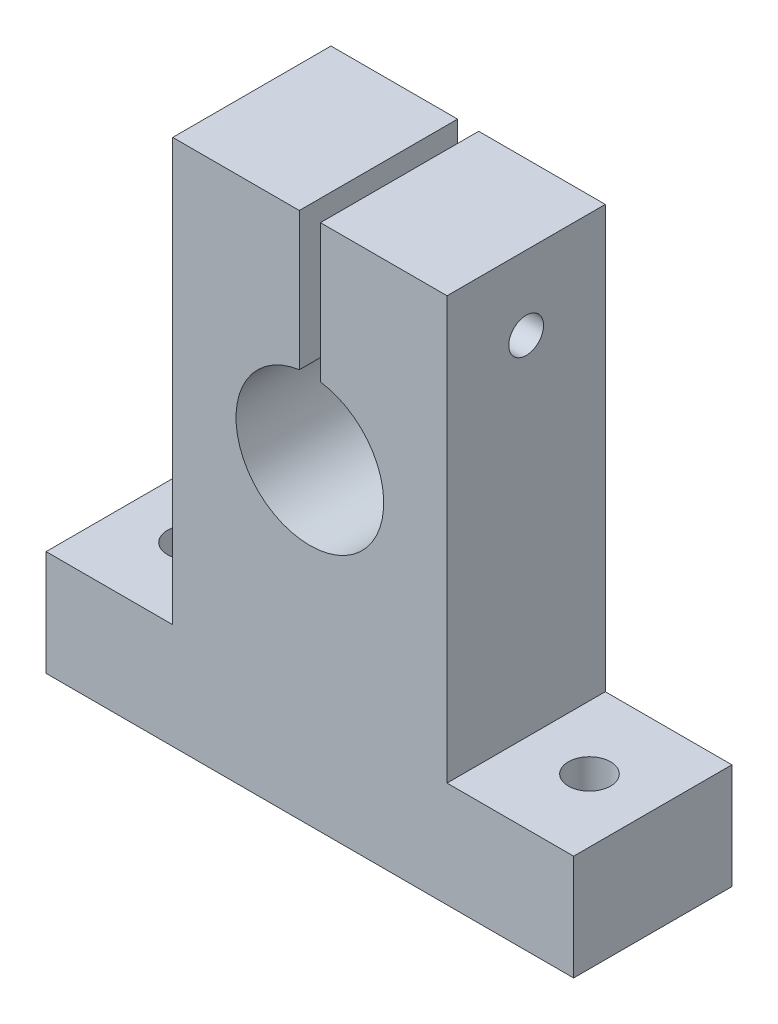
ISO-10303-21;
HEADER;
FILE_DESCRIPTION(('STEP AP214'),'2;1');
FILE_NAME('part.step','',(''),(''),'','','');
FILE_SCHEMA(('AUTOMOTIVE_DESIGN { 1 0 10303 214 1 1 1 1 }'));
ENDSEC;
DATA;
#1=APPLICATION_CONTEXT('core data for automotive mechanical design processes');
#2=APPLICATION_PROTOCOL_DEFINITION('international standard','automotive_design',2000,#1);
#3=PRODUCT_CONTEXT('',#1,'mechanical');
#4=PRODUCT('Part','Part','',(#3));
#5=PRODUCT_RELATED_PRODUCT_CATEGORY('part','',(#4));
#6=PRODUCT_DEFINITION_FORMATION('','',#4);
#7=PRODUCT_DEFINITION_CONTEXT('part definition',#1,'design');
#8=PRODUCT_DEFINITION('design','',#6,#7);
#9=PRODUCT_DEFINITION_SHAPE('','',#8);
#10=(LENGTH_UNIT() NAMED_UNIT(*) SI_UNIT(.MILLI.,.METRE.));
#11=(NAMED_UNIT(*) PLANE_ANGLE_UNIT() SI_UNIT($,.RADIAN.));
#12=(NAMED_UNIT(*) SI_UNIT($,.STERADIAN.) SOLID_ANGLE_UNIT());
#13=UNCERTAINTY_MEASURE_WITH_UNIT(LENGTH_MEASURE(1.E-05),#10,'distance_accuracy_value','');
#14=(GEOMETRIC_REPRESENTATION_CONTEXT(3) GLOBAL_UNCERTAINTY_ASSIGNED_CONTEXT((#13)) GLOBAL_UNIT_ASSIGNED_CONTEXT((#10,
#11,#12)) REPRESENTATION_CONTEXT('',''));
#15=CARTESIAN_POINT('',(0.,0.,0.));
#16=DIRECTION('',(0.,0.,1.));
#17=DIRECTION('',(1.,0.,0.));
#18=AXIS2_PLACEMENT_3D('',#15,#16,#17);
#19=CARTESIAN_POINT('',(12.,-50.,15.));
#20=DIRECTION('',(-1.,0.,0.));
#21=DIRECTION('',(0.,0.,1.));
#22=AXIS2_PLACEMENT_3D('',#19,#20,#21);
#23=PLANE('',#22);
#24=DIRECTION('',(0.,1.,0.));
#25=VECTOR('',#24,1.);
#26=CARTESIAN_POINT('',(12.,-50.,0.));
#27=LINE('',#26,#25);
#28=CARTESIAN_POINT('',(12.,-50.,0.));
#29=VERTEX_POINT('',#28);
#30=CARTESIAN_POINT('',(12.,-40.,0.));
#31=VERTEX_POINT('',#30);
#32=EDGE_CURVE('E157',#29,#31,#27,.T.);
#33=ORIENTED_EDGE('',*,*,#32,.T.);
#34=DIRECTION('',(0.,0.,-1.));
#35=VECTOR('',#34,1.);
#36=CARTESIAN_POINT('',(12.,-40.,15.));
#37=LINE('',#36,#35);
#38=CARTESIAN_POINT('',(12.,-40.,15.));
#39=VERTEX_POINT('',#38);
#40=EDGE_CURVE('E11',#39,#31,#37,.T.);
#41=ORIENTED_EDGE('',*,*,#40,.F.);
#42=DIRECTION('',(0.,1.,0.));
#43=VECTOR('',#42,1.);
#44=CARTESIAN_POINT('',(12.,-50.,15.));
#45=LINE('',#44,#43);
#46=CARTESIAN_POINT('',(12.,-50.,15.));
#47=VERTEX_POINT('',#46);
#48=EDGE_CURVE('E179',#47,#39,#45,.T.);
#49=ORIENTED_EDGE('',*,*,#48,.F.);
#50=DIRECTION('',(0.,0.,-1.));
#51=VECTOR('',#50,1.);
#52=CARTESIAN_POINT('',(12.,-50.,15.));
#53=LINE('',#52,#51);
#54=EDGE_CURVE('E153',#47,#29,#53,.T.);
#55=ORIENTED_EDGE('',*,*,#54,.T.);
#56=EDGE_LOOP('',(#33,#41,#49,#55));
#57=FACE_BOUND('',#56,.T.);
#58=ADVANCED_FACE('F35',(#57),#23,.F.);
#59=CARTESIAN_POINT('',(12.,-40.,15.));
#60=DIRECTION('',(0.,-1.,0.));
#61=DIRECTION('',(0.,0.,-1.));
#62=AXIS2_PLACEMENT_3D('',#59,#60,#61);
#63=PLANE('',#62);
#64=CARTESIAN_POINT('',(6.,-40.,7.5));
#65=DIRECTION('',(0.,1.,0.));
#66=DIRECTION('',(0.,0.,1.));
#67=AXIS2_PLACEMENT_3D('',#64,#65,#66);
#68=CIRCLE('',#67,2.);
#69=CARTESIAN_POINT('',(6.,-40.,9.5));
#70=VERTEX_POINT('',#69);
#71=EDGE_CURVE('E204',#70,#70,#68,.T.);
#72=ORIENTED_EDGE('',*,*,#71,.F.);
#73=EDGE_LOOP('',(#72));
#74=FACE_BOUND('',#73,.T.);
#75=DIRECTION('',(-1.,0.,0.));
#76=VECTOR('',#75,1.);
#77=CARTESIAN_POINT('',(12.,-40.,0.));
#78=LINE('',#77,#76);
#79=CARTESIAN_POINT('',(0.,-40.,0.));
#80=VERTEX_POINT('',#79);
#81=EDGE_CURVE('E160',#31,#80,#78,.T.);
#82=ORIENTED_EDGE('',*,*,#81,.T.);
#83=DIRECTION('',(0.,0.,-1.));
#84=VECTOR('',#83,1.);
#85=CARTESIAN_POINT('',(0.,-40.,15.));
#86=LINE('',#85,#84);
#87=CARTESIAN_POINT('',(0.,-40.,15.));
#88=VERTEX_POINT('',#87);
#89=EDGE_CURVE('E44',#88,#80,#86,.T.);
#90=ORIENTED_EDGE('',*,*,#89,.F.);
#91=DIRECTION('',(-1.,0.,0.));
#92=VECTOR('',#91,1.);
#93=CARTESIAN_POINT('',(12.,-40.,15.));
#94=LINE('',#93,#92);
#95=EDGE_CURVE('E108',#39,#88,#94,.T.);
#96=ORIENTED_EDGE('',*,*,#95,.F.);
#97=ORIENTED_EDGE('',*,*,#40,.T.);
#98=EDGE_LOOP('',(#82,#90,#96,#97));
#99=FACE_BOUND('',#98,.T.);
#100=ADVANCED_FACE('F261',(#74,#99),#63,.F.);
#101=CARTESIAN_POINT('',(0.,-40.,15.));
#102=DIRECTION('',(-1.,0.,0.));
#103=DIRECTION('',(0.,0.,1.));
#104=AXIS2_PLACEMENT_3D('',#101,#102,#103);
#105=PLANE('',#104);
#106=CARTESIAN_POINT('',(0.,-7.,7.5));
#107=DIRECTION('',(1.,0.,0.));
#108=DIRECTION('',(0.,0.,-1.));
#109=AXIS2_PLACEMENT_3D('',#106,#107,#108);
#110=CIRCLE('',#109,1.65);
#111=CARTESIAN_POINT('',(0.,-7.,5.85));
#112=VERTEX_POINT('',#111);
#113=EDGE_CURVE('E326',#112,#112,#110,.T.);
#114=ORIENTED_EDGE('',*,*,#113,.F.);
#115=EDGE_LOOP('',(#114));
#116=FACE_BOUND('',#115,.T.);
#117=DIRECTION('',(0.,1.,0.));
#118=VECTOR('',#117,1.);
#119=CARTESIAN_POINT('',(0.,-40.,0.));
#120=LINE('',#119,#118);
#121=CARTESIAN_POINT('',(0.,0.,0.));
#122=VERTEX_POINT('',#121);
#123=EDGE_CURVE('E162',#80,#122,#120,.T.);
#124=ORIENTED_EDGE('',*,*,#123,.T.);
#125=DIRECTION('',(0.,0.,-1.));
#126=VECTOR('',#125,1.);
#127=CARTESIAN_POINT('',(0.,0.,15.));
#128=LINE('',#127,#126);
#129=CARTESIAN_POINT('',(0.,0.,15.));
#130=VERTEX_POINT('',#129);
#131=EDGE_CURVE('E198',#130,#122,#128,.T.);
#132=ORIENTED_EDGE('',*,*,#131,.F.);
#133=DIRECTION('',(0.,1.,0.));
#134=VECTOR('',#133,1.);
#135=CARTESIAN_POINT('',(0.,-40.,15.));
#136=LINE('',#135,#134);
#137=EDGE_CURVE('E221',#88,#130,#136,.T.);
#138=ORIENTED_EDGE('',*,*,#137,.F.);
#139=ORIENTED_EDGE('',*,*,#89,.T.);
#140=EDGE_LOOP('',(#124,#132,#138,#139));
#141=FACE_BOUND('',#140,.T.);
#142=ADVANCED_FACE('F265',(#116,#141),#105,.F.);
#143=CARTESIAN_POINT('',(-12.,0.,15.));
#144=DIRECTION('',(0.,-1.,0.));
#145=DIRECTION('',(0.,0.,-1.));
#146=AXIS2_PLACEMENT_3D('',#143,#144,#145);
#147=PLANE('',#146);
#148=DIRECTION('',(-1.,0.,0.));
#149=VECTOR('',#148,1.);
#150=CARTESIAN_POINT('',(-12.,0.,0.));
#151=LINE('',#150,#149);
#152=CARTESIAN_POINT('',(-12.,0.,0.));
#153=VERTEX_POINT('',#152);
#154=EDGE_CURVE('E164',#122,#153,#151,.T.);
#155=ORIENTED_EDGE('',*,*,#154,.T.);
#156=DIRECTION('',(0.,0.,-1.));
#157=VECTOR('',#156,1.);
#158=CARTESIAN_POINT('',(-12.,0.,15.));
#159=LINE('',#158,#157);
#160=CARTESIAN_POINT('',(-12.,0.,15.));
#161=VERTEX_POINT('',#160);
#162=EDGE_CURVE('E195',#161,#153,#159,.T.);
#163=ORIENTED_EDGE('',*,*,#162,.F.);
#164=DIRECTION('',(-1.,0.,0.));
#165=VECTOR('',#164,1.);
#166=CARTESIAN_POINT('',(-12.,0.,15.));
#167=LINE('',#166,#165);
#168=EDGE_CURVE('E223',#130,#161,#167,.T.);
#169=ORIENTED_EDGE('',*,*,#168,.F.);
#170=ORIENTED_EDGE('',*,*,#131,.T.);
#171=EDGE_LOOP('',(#155,#163,#169,#170));
#172=FACE_BOUND('',#171,.T.);
#173=ADVANCED_FACE('F270',(#172),#147,.F.);
#174=CARTESIAN_POINT('',(-12.,0.,15.));
#175=DIRECTION('',(1.,0.,0.));
#176=DIRECTION('',(0.,1.,0.));
#177=AXIS2_PLACEMENT_3D('',#174,#175,#176);
#178=PLANE('',#177);
#179=CARTESIAN_POINT('',(-12.,-7.,7.5));
#180=DIRECTION('',(1.,0.,0.));
#181=DIRECTION('',(0.,1.,0.));
#182=AXIS2_PLACEMENT_3D('',#179,#180,#181);
#183=CIRCLE('',#182,1.65);
#184=CARTESIAN_POINT('',(-12.,-5.35,7.5));
#185=VERTEX_POINT('',#184);
#186=EDGE_CURVE('E323',#185,#185,#183,.T.);
#187=ORIENTED_EDGE('',*,*,#186,.T.);
#188=EDGE_LOOP('',(#187));
#189=FACE_BOUND('',#188,.T.);
#190=DIRECTION('',(0.,-1.,0.));
#191=VECTOR('',#190,1.);
#192=CARTESIAN_POINT('',(-12.,0.,0.));
#193=LINE('',#192,#191);
#194=CARTESIAN_POINT('',(-12.,-13.0717967697245,0.));
#195=VERTEX_POINT('',#194);
#196=EDGE_CURVE('E166',#153,#195,#193,.T.);
#197=ORIENTED_EDGE('',*,*,#196,.T.);
#198=DIRECTION('',(0.,0.,-1.));
#199=VECTOR('',#198,1.);
#200=CARTESIAN_POINT('',(-12.,-13.0717967697245,15.));
#201=LINE('',#200,#199);
#202=CARTESIAN_POINT('',(-12.,-13.0717967697245,15.));
#203=VERTEX_POINT('',#202);
#204=EDGE_CURVE('E192',#203,#195,#201,.T.);
#205=ORIENTED_EDGE('',*,*,#204,.F.);
#206=DIRECTION('',(0.,-1.,0.));
#207=VECTOR('',#206,1.);
#208=CARTESIAN_POINT('',(-12.,0.,15.));
#209=LINE('',#208,#207);
#210=EDGE_CURVE('E225',#161,#203,#209,.T.);
#211=ORIENTED_EDGE('',*,*,#210,.F.);
#212=ORIENTED_EDGE('',*,*,#162,.T.);
#213=EDGE_LOOP('',(#197,#205,#211,#212));
#214=FACE_BOUND('',#213,.T.);
#215=ADVANCED_FACE('F276',(#189,#214),#178,.F.);
#216=CARTESIAN_POINT('',(-13.,-20.,15.));
#217=DIRECTION('',(0.,0.,-1.));
#218=DIRECTION('',(-1.,0.,0.));
#219=AXIS2_PLACEMENT_3D('',#216,#217,#218);
#220=CYLINDRICAL_SURFACE('',#219,7.);
#221=CARTESIAN_POINT('',(-13.,-20.,0.));
#222=DIRECTION('',(0.,0.,-1.));
#223=DIRECTION('',(1.,0.,0.));
#224=AXIS2_PLACEMENT_3D('',#221,#222,#223);
#225=CIRCLE('',#224,7.);
#226=CARTESIAN_POINT('',(-14.,-13.0717967697245,0.));
#227=VERTEX_POINT('',#226);
#228=EDGE_CURVE('E168',#195,#227,#225,.T.);
#229=ORIENTED_EDGE('',*,*,#228,.T.);
#230=DIRECTION('',(0.,0.,-1.));
#231=VECTOR('',#230,1.);
#232=CARTESIAN_POINT('',(-14.,-13.0717967697245,15.));
#233=LINE('',#232,#231);
#234=CARTESIAN_POINT('',(-14.,-13.0717967697245,15.));
#235=VERTEX_POINT('',#234);
#236=EDGE_CURVE('E189',#235,#227,#233,.T.);
#237=ORIENTED_EDGE('',*,*,#236,.F.);
#238=CARTESIAN_POINT('',(-13.,-20.,15.));
#239=DIRECTION('',(0.,0.,-1.));
#240=DIRECTION('',(1.,0.,0.));
#241=AXIS2_PLACEMENT_3D('',#238,#239,#240);
#242=CIRCLE('',#241,7.);
#243=EDGE_CURVE('E227',#203,#235,#242,.T.);
#244=ORIENTED_EDGE('',*,*,#243,.F.);
#245=ORIENTED_EDGE('',*,*,#204,.T.);
#246=EDGE_LOOP('',(#229,#237,#244,#245));
#247=FACE_BOUND('',#246,.T.);
#248=ADVANCED_FACE('F280',(#247),#220,.F.);
#249=CARTESIAN_POINT('',(-14.,0.,15.));
#250=DIRECTION('',(-1.,0.,0.));
#251=DIRECTION('',(0.,-1.,0.));
#252=AXIS2_PLACEMENT_3D('',#249,#250,#251);
#253=PLANE('',#252);
#254=CARTESIAN_POINT('',(-14.,-7.,7.56985297052041));
#255=DIRECTION('',(-1.,0.,0.));
#256=DIRECTION('',(0.,-1.,0.));
#257=AXIS2_PLACEMENT_3D('',#254,#255,#256);
#258=CIRCLE('',#257,2.25);
#259=CARTESIAN_POINT('',(-14.,-9.25,7.56985297052041));
#260=VERTEX_POINT('',#259);
#261=EDGE_CURVE('E214',#260,#260,#258,.T.);
#262=ORIENTED_EDGE('',*,*,#261,.T.);
#263=EDGE_LOOP('',(#262));
#264=FACE_BOUND('',#263,.T.);
#265=DIRECTION('',(0.,1.,0.));
#266=VECTOR('',#265,1.);
#267=CARTESIAN_POINT('',(-14.,0.,0.));
#268=LINE('',#267,#266);
#269=CARTESIAN_POINT('',(-14.,0.,0.));
#270=VERTEX_POINT('',#269);
#271=EDGE_CURVE('E170',#227,#270,#268,.T.);
#272=ORIENTED_EDGE('',*,*,#271,.T.);
#273=DIRECTION('',(0.,0.,-1.));
#274=VECTOR('',#273,1.);
#275=CARTESIAN_POINT('',(-14.,0.,15.));
#276=LINE('',#275,#274);
#277=CARTESIAN_POINT('',(-14.,0.,15.));
#278=VERTEX_POINT('',#277);
#279=EDGE_CURVE('E186',#278,#270,#276,.T.);
#280=ORIENTED_EDGE('',*,*,#279,.F.);
#281=DIRECTION('',(0.,1.,0.));
#282=VECTOR('',#281,1.);
#283=CARTESIAN_POINT('',(-14.,0.,15.));
#284=LINE('',#283,#282);
#285=EDGE_CURVE('E229',#235,#278,#284,.T.);
#286=ORIENTED_EDGE('',*,*,#285,.F.);
#287=ORIENTED_EDGE('',*,*,#236,.T.);
#288=EDGE_LOOP('',(#272,#280,#286,#287));
#289=FACE_BOUND('',#288,.T.);
#290=ADVANCED_FACE('F284',(#264,#289),#253,.F.);
#291=CARTESIAN_POINT('',(-26.,0.,15.));
#292=DIRECTION('',(0.,-1.,0.));
#293=DIRECTION('',(0.,0.,-1.));
#294=AXIS2_PLACEMENT_3D('',#291,#292,#293);
#295=PLANE('',#294);
#296=DIRECTION('',(-1.,0.,0.));
#297=VECTOR('',#296,1.);
#298=CARTESIAN_POINT('',(-26.,0.,0.));
#299=LINE('',#298,#297);
#300=CARTESIAN_POINT('',(-26.,0.,0.));
#301=VERTEX_POINT('',#300);
#302=EDGE_CURVE('E172',#270,#301,#299,.T.);
#303=ORIENTED_EDGE('',*,*,#302,.T.);
#304=DIRECTION('',(0.,0.,-1.));
#305=VECTOR('',#304,1.);
#306=CARTESIAN_POINT('',(-26.,0.,15.));
#307=LINE('',#306,#305);
#308=CARTESIAN_POINT('',(-26.,0.,15.));
#309=VERTEX_POINT('',#308);
#310=EDGE_CURVE('E183',#309,#301,#307,.T.);
#311=ORIENTED_EDGE('',*,*,#310,.F.);
#312=DIRECTION('',(-1.,0.,0.));
#313=VECTOR('',#312,1.);
#314=CARTESIAN_POINT('',(-26.,0.,15.));
#315=LINE('',#314,#313);
#316=EDGE_CURVE('E231',#278,#309,#315,.T.);
#317=ORIENTED_EDGE('',*,*,#316,.F.);
#318=ORIENTED_EDGE('',*,*,#279,.T.);
#319=EDGE_LOOP('',(#303,#311,#317,#318));
#320=FACE_BOUND('',#319,.T.);
#321=ADVANCED_FACE('F237',(#320),#295,.F.);
#322=CARTESIAN_POINT('',(-26.,0.,15.));
#323=DIRECTION('',(1.,0.,0.));
#324=DIRECTION('',(0.,1.,0.));
#325=AXIS2_PLACEMENT_3D('',#322,#323,#324);
#326=PLANE('',#325);
#327=CARTESIAN_POINT('',(-26.,-7.,7.56985297052041));
#328=DIRECTION('',(-1.,0.,0.));
#329=DIRECTION('',(0.,0.,1.));
#330=AXIS2_PLACEMENT_3D('',#327,#328,#329);
#331=CIRCLE('',#330,2.25);
#332=CARTESIAN_POINT('',(-26.,-7.,9.81985297052041));
#333=VERTEX_POINT('',#332);
#334=EDGE_CURVE('E328',#333,#333,#331,.T.);
#335=ORIENTED_EDGE('',*,*,#334,.F.);
#336=EDGE_LOOP('',(#335));
#337=FACE_BOUND('',#336,.T.);
#338=DIRECTION('',(0.,-1.,0.));
#339=VECTOR('',#338,1.);
#340=CARTESIAN_POINT('',(-26.,0.,0.));
#341=LINE('',#340,#339);
#342=CARTESIAN_POINT('',(-26.,-40.,0.));
#343=VERTEX_POINT('',#342);
#344=EDGE_CURVE('E174',#301,#343,#341,.T.);
#345=ORIENTED_EDGE('',*,*,#344,.T.);
#346=DIRECTION('',(0.,0.,-1.));
#347=VECTOR('',#346,1.);
#348=CARTESIAN_POINT('',(-26.,-40.,15.));
#349=LINE('',#348,#347);
#350=CARTESIAN_POINT('',(-26.,-40.,15.));
#351=VERTEX_POINT('',#350);
#352=EDGE_CURVE('E148',#351,#343,#349,.T.);
#353=ORIENTED_EDGE('',*,*,#352,.F.);
#354=DIRECTION('',(0.,-1.,0.));
#355=VECTOR('',#354,1.);
#356=CARTESIAN_POINT('',(-26.,0.,15.));
#357=LINE('',#356,#355);
#358=EDGE_CURVE('E139',#309,#351,#357,.T.);
#359=ORIENTED_EDGE('',*,*,#358,.F.);
#360=ORIENTED_EDGE('',*,*,#310,.T.);
#361=EDGE_LOOP('',(#345,#353,#359,#360));
#362=FACE_BOUND('',#361,.T.);
#363=ADVANCED_FACE('F241',(#337,#362),#326,.F.);
#364=CARTESIAN_POINT('',(-26.,-40.,15.));
#365=DIRECTION('',(0.,-1.,0.));
#366=DIRECTION('',(1.,0.,0.));
#367=AXIS2_PLACEMENT_3D('',#364,#365,#366);
#368=PLANE('',#367);
#369=CARTESIAN_POINT('',(-32.,-40.,7.5));
#370=DIRECTION('',(0.,1.,0.));
#371=DIRECTION('',(0.,0.,1.));
#372=AXIS2_PLACEMENT_3D('',#369,#370,#371);
#373=CIRCLE('',#372,2.);
#374=CARTESIAN_POINT('',(-32.,-40.,9.5));
#375=VERTEX_POINT('',#374);
#376=EDGE_CURVE('E209',#375,#375,#373,.T.);
#377=ORIENTED_EDGE('',*,*,#376,.F.);
#378=EDGE_LOOP('',(#377));
#379=FACE_BOUND('',#378,.T.);
#380=DIRECTION('',(-1.,0.,0.));
#381=VECTOR('',#380,1.);
#382=CARTESIAN_POINT('',(-26.,-40.,0.));
#383=LINE('',#382,#381);
#384=CARTESIAN_POINT('',(-38.,-40.,0.));
#385=VERTEX_POINT('',#384);
#386=EDGE_CURVE('E147',#343,#385,#383,.T.);
#387=ORIENTED_EDGE('',*,*,#386,.T.);
#388=DIRECTION('',(0.,0.,-1.));
#389=VECTOR('',#388,1.);
#390=CARTESIAN_POINT('',(-38.,-40.,15.));
#391=LINE('',#390,#389);
#392=CARTESIAN_POINT('',(-38.,-40.,15.));
#393=VERTEX_POINT('',#392);
#394=EDGE_CURVE('E144',#393,#385,#391,.T.);
#395=ORIENTED_EDGE('',*,*,#394,.F.);
#396=DIRECTION('',(-1.,0.,0.));
#397=VECTOR('',#396,1.);
#398=CARTESIAN_POINT('',(-26.,-40.,15.));
#399=LINE('',#398,#397);
#400=EDGE_CURVE('E133',#351,#393,#399,.T.);
#401=ORIENTED_EDGE('',*,*,#400,.F.);
#402=ORIENTED_EDGE('',*,*,#352,.T.);
#403=EDGE_LOOP('',(#387,#395,#401,#402));
#404=FACE_BOUND('',#403,.T.);
#405=ADVANCED_FACE('F145',(#379,#404),#368,.F.);
#406=CARTESIAN_POINT('',(-38.,-40.,15.));
#407=DIRECTION('',(1.,0.,0.));
#408=DIRECTION('',(0.,0.,-1.));
#409=AXIS2_PLACEMENT_3D('',#406,#407,#408);
#410=PLANE('',#409);
#411=DIRECTION('',(0.,-1.,0.));
#412=VECTOR('',#411,1.);
#413=CARTESIAN_POINT('',(-38.,-40.,0.));
#414=LINE('',#413,#412);
#415=CARTESIAN_POINT('',(-38.,-50.,0.));
#416=VERTEX_POINT('',#415);
#417=EDGE_CURVE('E94',#385,#416,#414,.T.);
#418=ORIENTED_EDGE('',*,*,#417,.T.);
#419=DIRECTION('',(0.,0.,-1.));
#420=VECTOR('',#419,1.);
#421=CARTESIAN_POINT('',(-38.,-50.,15.));
#422=LINE('',#421,#420);
#423=CARTESIAN_POINT('',(-38.,-50.,15.));
#424=VERTEX_POINT('',#423);
#425=EDGE_CURVE('E149',#424,#416,#422,.T.);
#426=ORIENTED_EDGE('',*,*,#425,.F.);
#427=DIRECTION('',(0.,-1.,0.));
#428=VECTOR('',#427,1.);
#429=CARTESIAN_POINT('',(-38.,-40.,15.));
#430=LINE('',#429,#428);
#431=EDGE_CURVE('E137',#393,#424,#430,.T.);
#432=ORIENTED_EDGE('',*,*,#431,.F.);
#433=ORIENTED_EDGE('',*,*,#394,.T.);
#434=EDGE_LOOP('',(#418,#426,#432,#433));
#435=FACE_BOUND('',#434,.T.);
#436=ADVANCED_FACE('F151',(#435),#410,.F.);
#437=CARTESIAN_POINT('',(-38.,-50.,15.));
#438=DIRECTION('',(0.,1.,0.));
#439=DIRECTION('',(0.,0.,1.));
#440=AXIS2_PLACEMENT_3D('',#437,#438,#439);
#441=PLANE('',#440);
#442=CARTESIAN_POINT('',(6.,-50.,7.5));
#443=DIRECTION('',(0.,1.,0.));
#444=DIRECTION('',(0.,0.,1.));
#445=AXIS2_PLACEMENT_3D('',#442,#443,#444);
#446=CIRCLE('',#445,2.);
#447=CARTESIAN_POINT('',(6.,-50.,9.5));
#448=VERTEX_POINT('',#447);
#449=EDGE_CURVE('E38',#448,#448,#446,.T.);
#450=ORIENTED_EDGE('',*,*,#449,.T.);
#451=EDGE_LOOP('',(#450));
#452=FACE_BOUND('',#451,.T.);
#453=CARTESIAN_POINT('',(-32.,-50.,7.5));
#454=DIRECTION('',(0.,1.,0.));
#455=DIRECTION('',(0.,0.,1.));
#456=AXIS2_PLACEMENT_3D('',#453,#454,#455);
#457=CIRCLE('',#456,2.);
#458=CARTESIAN_POINT('',(-32.,-50.,9.5));
#459=VERTEX_POINT('',#458);
#460=EDGE_CURVE('E202',#459,#459,#457,.T.);
#461=ORIENTED_EDGE('',*,*,#460,.T.);
#462=EDGE_LOOP('',(#461));
#463=FACE_BOUND('',#462,.T.);
#464=DIRECTION('',(1.,0.,0.));
#465=VECTOR('',#464,1.);
#466=CARTESIAN_POINT('',(-38.,-50.,0.));
#467=LINE('',#466,#465);
#468=EDGE_CURVE('E100',#416,#29,#467,.T.);
#469=ORIENTED_EDGE('',*,*,#468,.T.);
#470=ORIENTED_EDGE('',*,*,#54,.F.);
#471=DIRECTION('',(1.,0.,0.));
#472=VECTOR('',#471,1.);
#473=CARTESIAN_POINT('',(-38.,-50.,15.));
#474=LINE('',#473,#472);
#475=EDGE_CURVE('E53',#424,#47,#474,.T.);
#476=ORIENTED_EDGE('',*,*,#475,.F.);
#477=ORIENTED_EDGE('',*,*,#425,.T.);
#478=EDGE_LOOP('',(#469,#470,#476,#477));
#479=FACE_BOUND('',#478,.T.);
#480=ADVANCED_FACE('F249',(#452,#463,#479),#441,.F.);
#481=CARTESIAN_POINT('',(-13.,-20.,15.));
#482=DIRECTION('',(0.,0.,1.));
#483=DIRECTION('',(1.,0.,0.));
#484=AXIS2_PLACEMENT_3D('',#481,#482,#483);
#485=PLANE('',#484);
#486=ORIENTED_EDGE('',*,*,#48,.T.);
#487=ORIENTED_EDGE('',*,*,#95,.T.);
#488=ORIENTED_EDGE('',*,*,#137,.T.);
#489=ORIENTED_EDGE('',*,*,#168,.T.);
#490=ORIENTED_EDGE('',*,*,#210,.T.);
#491=ORIENTED_EDGE('',*,*,#243,.T.);
#492=ORIENTED_EDGE('',*,*,#285,.T.);
#493=ORIENTED_EDGE('',*,*,#316,.T.);
#494=ORIENTED_EDGE('',*,*,#358,.T.);
#495=ORIENTED_EDGE('',*,*,#400,.T.);
#496=ORIENTED_EDGE('',*,*,#431,.T.);
#497=ORIENTED_EDGE('',*,*,#475,.T.);
#498=EDGE_LOOP('',(#486,#487,#488,#489,#490,#491,#492,#493,#494,#495,#496,#497));
#499=FACE_BOUND('',#498,.T.);
#500=ADVANCED_FACE('F135',(#499),#485,.T.);
#501=CARTESIAN_POINT('',(-13.,-20.,0.));
#502=DIRECTION('',(0.,0.,1.));
#503=DIRECTION('',(1.,0.,0.));
#504=AXIS2_PLACEMENT_3D('',#501,#502,#503);
#505=PLANE('',#504);
#506=ORIENTED_EDGE('',*,*,#32,.F.);
#507=ORIENTED_EDGE('',*,*,#468,.F.);
#508=ORIENTED_EDGE('',*,*,#417,.F.);
#509=ORIENTED_EDGE('',*,*,#386,.F.);
#510=ORIENTED_EDGE('',*,*,#344,.F.);
#511=ORIENTED_EDGE('',*,*,#302,.F.);
#512=ORIENTED_EDGE('',*,*,#271,.F.);
#513=ORIENTED_EDGE('',*,*,#228,.F.);
#514=ORIENTED_EDGE('',*,*,#196,.F.);
#515=ORIENTED_EDGE('',*,*,#154,.F.);
#516=ORIENTED_EDGE('',*,*,#123,.F.);
#517=ORIENTED_EDGE('',*,*,#81,.F.);
#518=EDGE_LOOP('',(#506,#507,#508,#509,#510,#511,#512,#513,#514,#515,#516,#517));
#519=FACE_BOUND('',#518,.T.);
#520=ADVANCED_FACE('F244',(#519),#505,.F.);
#521=CARTESIAN_POINT('',(-32.,-55.,7.5));
#522=DIRECTION('',(0.,1.,0.));
#523=DIRECTION('',(0.,0.,1.));
#524=AXIS2_PLACEMENT_3D('',#521,#522,#523);
#525=CYLINDRICAL_SURFACE('',#524,2.);
#526=ORIENTED_EDGE('',*,*,#376,.T.);
#527=EDGE_LOOP('',(#526));
#528=FACE_BOUND('',#527,.T.);
#529=ORIENTED_EDGE('',*,*,#460,.F.);
#530=EDGE_LOOP('',(#529));
#531=FACE_BOUND('',#530,.T.);
#532=ADVANCED_FACE('F300',(#528,#531),#525,.F.);
#533=CARTESIAN_POINT('',(6.,-55.,7.5));
#534=DIRECTION('',(0.,1.,0.));
#535=DIRECTION('',(0.,0.,1.));
#536=AXIS2_PLACEMENT_3D('',#533,#534,#535);
#537=CYLINDRICAL_SURFACE('',#536,2.);
#538=ORIENTED_EDGE('',*,*,#71,.T.);
#539=EDGE_LOOP('',(#538));
#540=FACE_BOUND('',#539,.T.);
#541=ORIENTED_EDGE('',*,*,#449,.F.);
#542=EDGE_LOOP('',(#541));
#543=FACE_BOUND('',#542,.T.);
#544=ADVANCED_FACE('F303',(#540,#543),#537,.F.);
#545=CARTESIAN_POINT('',(-26.,-7.,7.56985297052041));
#546=DIRECTION('',(-1.,0.,0.));
#547=DIRECTION('',(0.,0.,1.));
#548=AXIS2_PLACEMENT_3D('',#545,#546,#547);
#549=CYLINDRICAL_SURFACE('',#548,2.25);
#550=ORIENTED_EDGE('',*,*,#261,.F.);
#551=EDGE_LOOP('',(#550));
#552=FACE_BOUND('',#551,.T.);
#553=ORIENTED_EDGE('',*,*,#334,.T.);
#554=EDGE_LOOP('',(#553));
#555=FACE_BOUND('',#554,.T.);
#556=ADVANCED_FACE('F309',(#552,#555),#549,.F.);
#557=CARTESIAN_POINT('',(0.,-7.,7.5));
#558=DIRECTION('',(1.,0.,0.));
#559=DIRECTION('',(0.,0.,-1.));
#560=AXIS2_PLACEMENT_3D('',#557,#558,#559);
#561=CYLINDRICAL_SURFACE('',#560,1.65);
#562=ORIENTED_EDGE('',*,*,#186,.F.);
#563=EDGE_LOOP('',(#562));
#564=FACE_BOUND('',#563,.T.);
#565=ORIENTED_EDGE('',*,*,#113,.T.);
#566=EDGE_LOOP('',(#565));
#567=FACE_BOUND('',#566,.T.);
#568=ADVANCED_FACE('F314',(#564,#567),#561,.F.);
#569=CLOSED_SHELL('',(#58,#100,#142,#173,#215,#248,#290,#321,#363,#405,#436,#480,#500,#520,#532,
#544,#556,#568));
#570=MANIFOLD_SOLID_BREP('B2',#569);
#571=ADVANCED_BREP_SHAPE_REPRESENTATION('',(#18,#570),#14);
#572=SHAPE_DEFINITION_REPRESENTATION(#9,#571);
ENDSEC;
END-ISO-10303-21;
